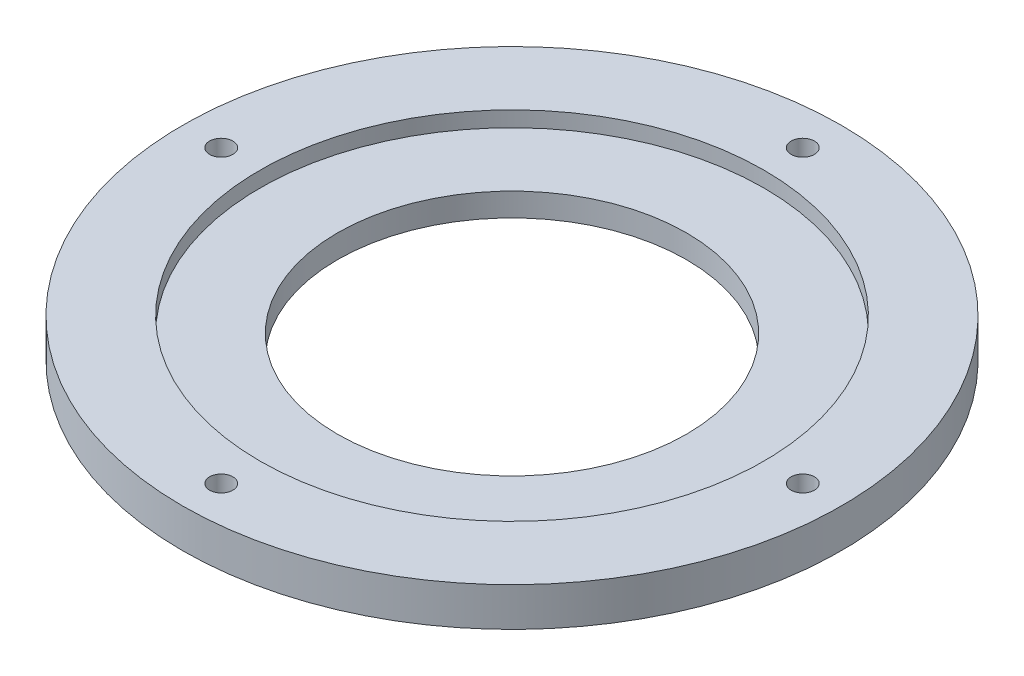
ISO-10303-21;
HEADER;
FILE_DESCRIPTION(('STEP AP214'),'2;1');
FILE_NAME('part.step','',(''),(''),'','','');
FILE_SCHEMA(('AUTOMOTIVE_DESIGN { 1 0 10303 214 1 1 1 1 }'));
ENDSEC;
DATA;
#1=APPLICATION_CONTEXT('core data for automotive mechanical design processes');
#2=APPLICATION_PROTOCOL_DEFINITION('international standard','automotive_design',2000,#1);
#3=PRODUCT_CONTEXT('',#1,'mechanical');
#4=PRODUCT('Part','Part','',(#3));
#5=PRODUCT_RELATED_PRODUCT_CATEGORY('part','',(#4));
#6=PRODUCT_DEFINITION_FORMATION('','',#4);
#7=PRODUCT_DEFINITION_CONTEXT('part definition',#1,'design');
#8=PRODUCT_DEFINITION('design','',#6,#7);
#9=PRODUCT_DEFINITION_SHAPE('','',#8);
#10=(LENGTH_UNIT() NAMED_UNIT(*) SI_UNIT(.MILLI.,.METRE.));
#11=(NAMED_UNIT(*) PLANE_ANGLE_UNIT() SI_UNIT($,.RADIAN.));
#12=(NAMED_UNIT(*) SI_UNIT($,.STERADIAN.) SOLID_ANGLE_UNIT());
#13=UNCERTAINTY_MEASURE_WITH_UNIT(LENGTH_MEASURE(1.E-05),#10,'distance_accuracy_value','');
#14=(GEOMETRIC_REPRESENTATION_CONTEXT(3) GLOBAL_UNCERTAINTY_ASSIGNED_CONTEXT((#13)) GLOBAL_UNIT_ASSIGNED_CONTEXT((#10,
#11,#12)) REPRESENTATION_CONTEXT('',''));
#15=CARTESIAN_POINT('',(0.,0.,0.));
#16=DIRECTION('',(0.,0.,1.));
#17=DIRECTION('',(1.,0.,0.));
#18=AXIS2_PLACEMENT_3D('',#15,#16,#17);
#19=CARTESIAN_POINT('',(0.,3.,0.));
#20=DIRECTION('',(0.,1.,0.));
#21=DIRECTION('',(0.,0.,1.));
#22=AXIS2_PLACEMENT_3D('',#19,#20,#21);
#23=CYLINDRICAL_SURFACE('',#22,32.5);
#24=CARTESIAN_POINT('',(0.,5.,0.));
#25=DIRECTION('',(0.,1.,0.));
#26=DIRECTION('',(0.,0.,1.));
#27=AXIS2_PLACEMENT_3D('',#24,#25,#26);
#28=CIRCLE('',#27,32.5);
#29=CARTESIAN_POINT('',(0.,5.,32.5));
#30=VERTEX_POINT('',#29);
#31=EDGE_CURVE('E18',#30,#30,#28,.F.);
#32=ORIENTED_EDGE('',*,*,#31,.F.);
#33=EDGE_LOOP('',(#32));
#34=FACE_BOUND('',#33,.T.);
#35=CARTESIAN_POINT('',(0.,3.,0.));
#36=DIRECTION('',(0.,1.,0.));
#37=DIRECTION('',(0.,0.,1.));
#38=AXIS2_PLACEMENT_3D('',#35,#36,#37);
#39=CIRCLE('',#38,32.5);
#40=CARTESIAN_POINT('',(0.,3.,32.5));
#41=VERTEX_POINT('',#40);
#42=EDGE_CURVE('E58',#41,#41,#39,.T.);
#43=ORIENTED_EDGE('',*,*,#42,.F.);
#44=EDGE_LOOP('',(#43));
#45=FACE_BOUND('',#44,.T.);
#46=ADVANCED_FACE('F15',(#34,#45),#23,.F.);
#47=CARTESIAN_POINT('',(0.,5.,0.));
#48=DIRECTION('',(0.,1.,0.));
#49=DIRECTION('',(0.,0.,1.));
#50=AXIS2_PLACEMENT_3D('',#47,#48,#49);
#51=PLANE('',#50);
#52=CARTESIAN_POINT('',(0.,5.,0.));
#53=DIRECTION('',(0.,-1.,0.));
#54=DIRECTION('',(0.,0.,-1.));
#55=AXIS2_PLACEMENT_3D('',#52,#53,#54);
#56=CIRCLE('',#55,42.5);
#57=CARTESIAN_POINT('',(0.,5.,-42.5));
#58=VERTEX_POINT('',#57);
#59=EDGE_CURVE('E44',#58,#58,#56,.T.);
#60=ORIENTED_EDGE('',*,*,#59,.F.);
#61=EDGE_LOOP('',(#60));
#62=FACE_BOUND('',#61,.T.);
#63=ORIENTED_EDGE('',*,*,#31,.T.);
#64=EDGE_LOOP('',(#63));
#65=FACE_BOUND('',#64,.T.);
#66=CARTESIAN_POINT('',(37.5,5.,0.));
#67=DIRECTION('',(0.,1.,0.));
#68=DIRECTION('',(0.,0.,1.));
#69=AXIS2_PLACEMENT_3D('',#66,#67,#68);
#70=CIRCLE('',#69,1.5);
#71=CARTESIAN_POINT('',(37.5,5.,1.5));
#72=VERTEX_POINT('',#71);
#73=EDGE_CURVE('E47',#72,#72,#70,.F.);
#74=ORIENTED_EDGE('',*,*,#73,.T.);
#75=EDGE_LOOP('',(#74));
#76=FACE_BOUND('',#75,.T.);
#77=CARTESIAN_POINT('',(-1.30930550206618E-13,5.,37.5));
#78=DIRECTION('',(0.,1.,0.));
#79=DIRECTION('',(0.,0.,1.));
#80=AXIS2_PLACEMENT_3D('',#77,#78,#79);
#81=CIRCLE('',#80,1.5);
#82=CARTESIAN_POINT('',(-1.30930550206618E-13,5.,39.));
#83=VERTEX_POINT('',#82);
#84=EDGE_CURVE('E50',#83,#83,#81,.F.);
#85=ORIENTED_EDGE('',*,*,#84,.T.);
#86=EDGE_LOOP('',(#85));
#87=FACE_BOUND('',#86,.T.);
#88=CARTESIAN_POINT('',(-37.5,5.,0.));
#89=DIRECTION('',(0.,1.,0.));
#90=DIRECTION('',(0.,0.,1.));
#91=AXIS2_PLACEMENT_3D('',#88,#89,#90);
#92=CIRCLE('',#91,1.5);
#93=CARTESIAN_POINT('',(-37.5,5.,1.5));
#94=VERTEX_POINT('',#93);
#95=EDGE_CURVE('E53',#94,#94,#92,.F.);
#96=ORIENTED_EDGE('',*,*,#95,.T.);
#97=EDGE_LOOP('',(#96));
#98=FACE_BOUND('',#97,.T.);
#99=CARTESIAN_POINT('',(3.92791650619852E-13,5.,-37.5));
#100=DIRECTION('',(0.,1.,0.));
#101=DIRECTION('',(0.,0.,1.));
#102=AXIS2_PLACEMENT_3D('',#99,#100,#101);
#103=CIRCLE('',#102,1.5);
#104=CARTESIAN_POINT('',(3.92791650619852E-13,5.,-36.));
#105=VERTEX_POINT('',#104);
#106=EDGE_CURVE('E56',#105,#105,#103,.F.);
#107=ORIENTED_EDGE('',*,*,#106,.T.);
#108=EDGE_LOOP('',(#107));
#109=FACE_BOUND('',#108,.T.);
#110=ADVANCED_FACE('F65',(#62,#65,#76,#87,#98,#109),#51,.T.);
#111=CARTESIAN_POINT('',(0.,3.,0.));
#112=DIRECTION('',(0.,1.,0.));
#113=DIRECTION('',(0.,0.,1.));
#114=AXIS2_PLACEMENT_3D('',#111,#112,#113);
#115=PLANE('',#114);
#116=ORIENTED_EDGE('',*,*,#42,.T.);
#117=EDGE_LOOP('',(#116));
#118=FACE_BOUND('',#117,.T.);
#119=CARTESIAN_POINT('',(0.,3.,0.));
#120=DIRECTION('',(0.,-1.,0.));
#121=DIRECTION('',(0.,0.,-1.));
#122=AXIS2_PLACEMENT_3D('',#119,#120,#121);
#123=CIRCLE('',#122,22.5);
#124=CARTESIAN_POINT('',(0.,3.,-22.5));
#125=VERTEX_POINT('',#124);
#126=EDGE_CURVE('E41',#125,#125,#123,.T.);
#127=ORIENTED_EDGE('',*,*,#126,.T.);
#128=EDGE_LOOP('',(#127));
#129=FACE_BOUND('',#128,.T.);
#130=ADVANCED_FACE('F74',(#118,#129),#115,.T.);
#131=CARTESIAN_POINT('',(3.92791650619852E-13,0.,-37.5));
#132=DIRECTION('',(0.,1.,0.));
#133=DIRECTION('',(0.,0.,1.));
#134=AXIS2_PLACEMENT_3D('',#131,#132,#133);
#135=CYLINDRICAL_SURFACE('',#134,1.5);
#136=CARTESIAN_POINT('',(3.92791650619852E-13,0.,-37.5));
#137=DIRECTION('',(0.,1.,0.));
#138=DIRECTION('',(0.,0.,1.));
#139=AXIS2_PLACEMENT_3D('',#136,#137,#138);
#140=CIRCLE('',#139,1.5);
#141=CARTESIAN_POINT('',(3.92791650619852E-13,0.,-36.));
#142=VERTEX_POINT('',#141);
#143=EDGE_CURVE('E38',#142,#142,#140,.F.);
#144=ORIENTED_EDGE('',*,*,#143,.T.);
#145=EDGE_LOOP('',(#144));
#146=FACE_BOUND('',#145,.T.);
#147=ORIENTED_EDGE('',*,*,#106,.F.);
#148=EDGE_LOOP('',(#147));
#149=FACE_BOUND('',#148,.T.);
#150=ADVANCED_FACE('F102',(#146,#149),#135,.F.);
#151=CARTESIAN_POINT('',(-37.5,0.,0.));
#152=DIRECTION('',(0.,1.,0.));
#153=DIRECTION('',(0.,0.,1.));
#154=AXIS2_PLACEMENT_3D('',#151,#152,#153);
#155=CYLINDRICAL_SURFACE('',#154,1.5);
#156=CARTESIAN_POINT('',(-37.5,0.,0.));
#157=DIRECTION('',(0.,1.,0.));
#158=DIRECTION('',(0.,0.,1.));
#159=AXIS2_PLACEMENT_3D('',#156,#157,#158);
#160=CIRCLE('',#159,1.5);
#161=CARTESIAN_POINT('',(-37.5,0.,1.5));
#162=VERTEX_POINT('',#161);
#163=EDGE_CURVE('E35',#162,#162,#160,.F.);
#164=ORIENTED_EDGE('',*,*,#163,.T.);
#165=EDGE_LOOP('',(#164));
#166=FACE_BOUND('',#165,.T.);
#167=ORIENTED_EDGE('',*,*,#95,.F.);
#168=EDGE_LOOP('',(#167));
#169=FACE_BOUND('',#168,.T.);
#170=ADVANCED_FACE('F98',(#166,#169),#155,.F.);
#171=CARTESIAN_POINT('',(-1.30930550206618E-13,0.,37.5));
#172=DIRECTION('',(0.,1.,0.));
#173=DIRECTION('',(0.,0.,1.));
#174=AXIS2_PLACEMENT_3D('',#171,#172,#173);
#175=CYLINDRICAL_SURFACE('',#174,1.5);
#176=CARTESIAN_POINT('',(-1.30930550206618E-13,0.,37.5));
#177=DIRECTION('',(0.,1.,0.));
#178=DIRECTION('',(0.,0.,1.));
#179=AXIS2_PLACEMENT_3D('',#176,#177,#178);
#180=CIRCLE('',#179,1.5);
#181=CARTESIAN_POINT('',(-1.30930550206618E-13,0.,39.));
#182=VERTEX_POINT('',#181);
#183=EDGE_CURVE('E32',#182,#182,#180,.F.);
#184=ORIENTED_EDGE('',*,*,#183,.T.);
#185=EDGE_LOOP('',(#184));
#186=FACE_BOUND('',#185,.T.);
#187=ORIENTED_EDGE('',*,*,#84,.F.);
#188=EDGE_LOOP('',(#187));
#189=FACE_BOUND('',#188,.T.);
#190=ADVANCED_FACE('F94',(#186,#189),#175,.F.);
#191=CARTESIAN_POINT('',(37.5,0.,0.));
#192=DIRECTION('',(0.,1.,0.));
#193=DIRECTION('',(0.,0.,1.));
#194=AXIS2_PLACEMENT_3D('',#191,#192,#193);
#195=CYLINDRICAL_SURFACE('',#194,1.5);
#196=CARTESIAN_POINT('',(37.5,0.,0.));
#197=DIRECTION('',(0.,1.,0.));
#198=DIRECTION('',(0.,0.,1.));
#199=AXIS2_PLACEMENT_3D('',#196,#197,#198);
#200=CIRCLE('',#199,1.5);
#201=CARTESIAN_POINT('',(37.5,0.,1.5));
#202=VERTEX_POINT('',#201);
#203=EDGE_CURVE('E27',#202,#202,#200,.F.);
#204=ORIENTED_EDGE('',*,*,#203,.T.);
#205=EDGE_LOOP('',(#204));
#206=FACE_BOUND('',#205,.T.);
#207=ORIENTED_EDGE('',*,*,#73,.F.);
#208=EDGE_LOOP('',(#207));
#209=FACE_BOUND('',#208,.T.);
#210=ADVANCED_FACE('F90',(#206,#209),#195,.F.);
#211=CARTESIAN_POINT('',(0.,5.,0.));
#212=DIRECTION('',(0.,-1.,0.));
#213=DIRECTION('',(0.,0.,-1.));
#214=AXIS2_PLACEMENT_3D('',#211,#212,#213);
#215=CYLINDRICAL_SURFACE('',#214,42.5);
#216=ORIENTED_EDGE('',*,*,#59,.T.);
#217=EDGE_LOOP('',(#216));
#218=FACE_BOUND('',#217,.T.);
#219=CARTESIAN_POINT('',(0.,0.,0.));
#220=DIRECTION('',(0.,-1.,0.));
#221=DIRECTION('',(0.,0.,-1.));
#222=AXIS2_PLACEMENT_3D('',#219,#220,#221);
#223=CIRCLE('',#222,42.5);
#224=CARTESIAN_POINT('',(0.,0.,-42.5));
#225=VERTEX_POINT('',#224);
#226=EDGE_CURVE('E22',#225,#225,#223,.F.);
#227=ORIENTED_EDGE('',*,*,#226,.T.);
#228=EDGE_LOOP('',(#227));
#229=FACE_BOUND('',#228,.T.);
#230=ADVANCED_FACE('F84',(#218,#229),#215,.T.);
#231=CARTESIAN_POINT('',(0.,5.,0.));
#232=DIRECTION('',(0.,-1.,0.));
#233=DIRECTION('',(0.,0.,-1.));
#234=AXIS2_PLACEMENT_3D('',#231,#232,#233);
#235=CYLINDRICAL_SURFACE('',#234,22.5);
#236=CARTESIAN_POINT('',(0.,0.,0.));
#237=DIRECTION('',(0.,-1.,0.));
#238=DIRECTION('',(0.,0.,-1.));
#239=AXIS2_PLACEMENT_3D('',#236,#237,#238);
#240=CIRCLE('',#239,22.5);
#241=CARTESIAN_POINT('',(0.,0.,-22.5));
#242=VERTEX_POINT('',#241);
#243=EDGE_CURVE('E10',#242,#242,#240,.T.);
#244=ORIENTED_EDGE('',*,*,#243,.T.);
#245=EDGE_LOOP('',(#244));
#246=FACE_BOUND('',#245,.T.);
#247=ORIENTED_EDGE('',*,*,#126,.F.);
#248=EDGE_LOOP('',(#247));
#249=FACE_BOUND('',#248,.T.);
#250=ADVANCED_FACE('F78',(#246,#249),#235,.F.);
#251=CARTESIAN_POINT('',(0.,0.,0.));
#252=DIRECTION('',(0.,1.,0.));
#253=DIRECTION('',(0.,0.,1.));
#254=AXIS2_PLACEMENT_3D('',#251,#252,#253);
#255=PLANE('',#254);
#256=ORIENTED_EDGE('',*,*,#243,.F.);
#257=EDGE_LOOP('',(#256));
#258=FACE_BOUND('',#257,.T.);
#259=ORIENTED_EDGE('',*,*,#226,.F.);
#260=EDGE_LOOP('',(#259));
#261=FACE_BOUND('',#260,.T.);
#262=ORIENTED_EDGE('',*,*,#203,.F.);
#263=EDGE_LOOP('',(#262));
#264=FACE_BOUND('',#263,.T.);
#265=ORIENTED_EDGE('',*,*,#183,.F.);
#266=EDGE_LOOP('',(#265));
#267=FACE_BOUND('',#266,.T.);
#268=ORIENTED_EDGE('',*,*,#163,.F.);
#269=EDGE_LOOP('',(#268));
#270=FACE_BOUND('',#269,.T.);
#271=ORIENTED_EDGE('',*,*,#143,.F.);
#272=EDGE_LOOP('',(#271));
#273=FACE_BOUND('',#272,.T.);
#274=ADVANCED_FACE('F76',(#258,#261,#264,#267,#270,#273),#255,.F.);
#275=CLOSED_SHELL('',(#46,#110,#130,#150,#170,#190,#210,#230,#250,#274));
#276=MANIFOLD_SOLID_BREP('B1',#275);
#277=ADVANCED_BREP_SHAPE_REPRESENTATION('',(#18,#276),#14);
#278=SHAPE_DEFINITION_REPRESENTATION(#9,#277);
ENDSEC;
END-ISO-10303-21;
